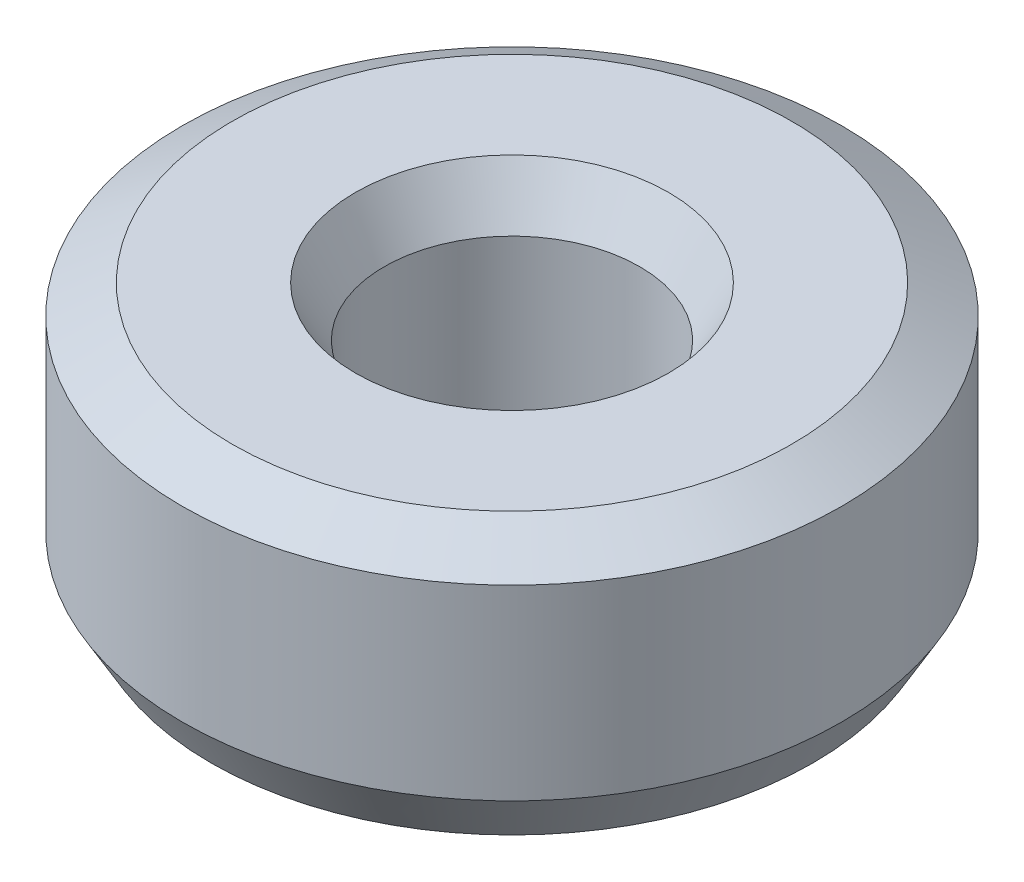
ISO-10303-21;
HEADER;
FILE_DESCRIPTION(('STEP AP214'),'2;1');
FILE_NAME('part.step','',(''),(''),'','','');
FILE_SCHEMA(('AUTOMOTIVE_DESIGN { 1 0 10303 214 1 1 1 1 }'));
ENDSEC;
DATA;
#1=APPLICATION_CONTEXT('core data for automotive mechanical design processes');
#2=APPLICATION_PROTOCOL_DEFINITION('international standard','automotive_design',2000,#1);
#3=PRODUCT_CONTEXT('',#1,'mechanical');
#4=PRODUCT('Part','Part','',(#3));
#5=PRODUCT_RELATED_PRODUCT_CATEGORY('part','',(#4));
#6=PRODUCT_DEFINITION_FORMATION('','',#4);
#7=PRODUCT_DEFINITION_CONTEXT('part definition',#1,'design');
#8=PRODUCT_DEFINITION('design','',#6,#7);
#9=PRODUCT_DEFINITION_SHAPE('','',#8);
#10=(LENGTH_UNIT() NAMED_UNIT(*) SI_UNIT(.MILLI.,.METRE.));
#11=(NAMED_UNIT(*) PLANE_ANGLE_UNIT() SI_UNIT($,.RADIAN.));
#12=(NAMED_UNIT(*) SI_UNIT($,.STERADIAN.) SOLID_ANGLE_UNIT());
#13=UNCERTAINTY_MEASURE_WITH_UNIT(LENGTH_MEASURE(1.E-05),#10,'distance_accuracy_value','');
#14=(GEOMETRIC_REPRESENTATION_CONTEXT(3) GLOBAL_UNCERTAINTY_ASSIGNED_CONTEXT((#13)) GLOBAL_UNIT_ASSIGNED_CONTEXT((#10,
#11,#12)) REPRESENTATION_CONTEXT('',''));
#15=CARTESIAN_POINT('',(0.,0.,0.));
#16=DIRECTION('',(0.,0.,1.));
#17=DIRECTION('',(1.,0.,0.));
#18=AXIS2_PLACEMENT_3D('',#15,#16,#17);
#19=CARTESIAN_POINT('',(0.,10.0671098100684,0.));
#20=DIRECTION('',(0.,-1.,0.));
#21=DIRECTION('',(0.,0.,-1.));
#22=AXIS2_PLACEMENT_3D('',#19,#20,#21);
#23=CYLINDRICAL_SURFACE('',#22,12.5);
#24=CARTESIAN_POINT('',(0.,1.89234666009191,0.));
#25=DIRECTION('',(0.,1.,0.));
#26=DIRECTION('',(0.,0.,1.));
#27=AXIS2_PLACEMENT_3D('',#24,#25,#26);
#28=CIRCLE('',#27,12.5);
#29=CARTESIAN_POINT('',(0.,1.89234666009191,12.5));
#30=VERTEX_POINT('',#29);
#31=EDGE_CURVE('E10',#30,#30,#28,.T.);
#32=ORIENTED_EDGE('',*,*,#31,.T.);
#33=EDGE_LOOP('',(#32));
#34=FACE_BOUND('',#33,.T.);
#35=CARTESIAN_POINT('',(0.,8.97456295646425,0.));
#36=DIRECTION('',(0.,1.,0.));
#37=DIRECTION('',(0.,0.,1.));
#38=AXIS2_PLACEMENT_3D('',#35,#36,#37);
#39=CIRCLE('',#38,12.5);
#40=CARTESIAN_POINT('',(0.,8.97456295646425,12.5));
#41=VERTEX_POINT('',#40);
#42=EDGE_CURVE('E50',#41,#41,#39,.F.);
#43=ORIENTED_EDGE('',*,*,#42,.T.);
#44=EDGE_LOOP('',(#43));
#45=FACE_BOUND('',#44,.T.);
#46=ADVANCED_FACE('F39',(#34,#45),#23,.T.);
#47=CARTESIAN_POINT('',(0.,10.0671098100684,0.));
#48=DIRECTION('',(0.,1.,0.));
#49=DIRECTION('',(0.,0.,1.));
#50=AXIS2_PLACEMENT_3D('',#47,#48,#49);
#51=PLANE('',#50);
#52=CARTESIAN_POINT('',(0.,10.0671098100684,0.));
#53=DIRECTION('',(0.,1.,0.));
#54=DIRECTION('',(0.,0.,1.));
#55=AXIS2_PLACEMENT_3D('',#52,#53,#54);
#56=CIRCLE('',#55,5.93592011887375);
#57=CARTESIAN_POINT('',(0.,10.0671098100684,5.93592011887375));
#58=VERTEX_POINT('',#57);
#59=EDGE_CURVE('E58',#58,#58,#56,.F.);
#60=ORIENTED_EDGE('',*,*,#59,.T.);
#61=EDGE_LOOP('',(#60));
#62=FACE_BOUND('',#61,.T.);
#63=CARTESIAN_POINT('',(0.,10.0671098100684,0.));
#64=DIRECTION('',(0.,1.,0.));
#65=DIRECTION('',(0.,0.,1.));
#66=AXIS2_PLACEMENT_3D('',#63,#64,#65);
#67=CIRCLE('',#66,10.6076533399081);
#68=CARTESIAN_POINT('',(0.,10.0671098100684,10.6076533399081));
#69=VERTEX_POINT('',#68);
#70=EDGE_CURVE('E61',#69,#69,#67,.T.);
#71=ORIENTED_EDGE('',*,*,#70,.T.);
#72=EDGE_LOOP('',(#71));
#73=FACE_BOUND('',#72,.T.);
#74=ADVANCED_FACE('F88',(#62,#73),#51,.T.);
#75=CARTESIAN_POINT('',(0.,0.,0.));
#76=DIRECTION('',(0.,1.,0.));
#77=DIRECTION('',(0.,0.,1.));
#78=AXIS2_PLACEMENT_3D('',#75,#76,#77);
#79=PLANE('',#78);
#80=CARTESIAN_POINT('',(0.,0.,0.));
#81=DIRECTION('',(0.,1.,0.));
#82=DIRECTION('',(0.,0.,1.));
#83=AXIS2_PLACEMENT_3D('',#80,#81,#82);
#84=CIRCLE('',#83,6.73571992536152);
#85=CARTESIAN_POINT('',(0.,0.,6.73571992536152));
#86=VERTEX_POINT('',#85);
#87=EDGE_CURVE('E51',#86,#86,#84,.T.);
#88=ORIENTED_EDGE('',*,*,#87,.T.);
#89=EDGE_LOOP('',(#88));
#90=FACE_BOUND('',#89,.T.);
#91=CARTESIAN_POINT('',(0.,0.,0.));
#92=DIRECTION('',(0.,1.,0.));
#93=DIRECTION('',(0.,0.,1.));
#94=AXIS2_PLACEMENT_3D('',#91,#92,#93);
#95=CIRCLE('',#94,11.4074531463958);
#96=CARTESIAN_POINT('',(0.,0.,11.4074531463958));
#97=VERTEX_POINT('',#96);
#98=EDGE_CURVE('E54',#97,#97,#95,.F.);
#99=ORIENTED_EDGE('',*,*,#98,.T.);
#100=EDGE_LOOP('',(#99));
#101=FACE_BOUND('',#100,.T.);
#102=ADVANCED_FACE('F83',(#90,#101),#79,.F.);
#103=CARTESIAN_POINT('',(0.,10.0671098100684,0.));
#104=DIRECTION('',(0.,-1.,0.));
#105=DIRECTION('',(0.,0.,-1.));
#106=AXIS2_PLACEMENT_3D('',#103,#104,#105);
#107=CYLINDRICAL_SURFACE('',#106,4.84337326526959);
#108=CARTESIAN_POINT('',(0.,8.1747631499765,0.));
#109=DIRECTION('',(0.,1.,0.));
#110=DIRECTION('',(0.,0.,1.));
#111=AXIS2_PLACEMENT_3D('',#108,#109,#110);
#112=CIRCLE('',#111,4.84337326526959);
#113=CARTESIAN_POINT('',(0.,8.1747631499765,4.84337326526959));
#114=VERTEX_POINT('',#113);
#115=EDGE_CURVE('E67',#114,#114,#112,.T.);
#116=ORIENTED_EDGE('',*,*,#115,.T.);
#117=EDGE_LOOP('',(#116));
#118=FACE_BOUND('',#117,.T.);
#119=CARTESIAN_POINT('',(0.,1.09254685360417,0.));
#120=DIRECTION('',(0.,1.,0.));
#121=DIRECTION('',(0.,0.,1.));
#122=AXIS2_PLACEMENT_3D('',#119,#120,#121);
#123=CIRCLE('',#122,4.84337326526959);
#124=CARTESIAN_POINT('',(0.,1.09254685360417,4.84337326526959));
#125=VERTEX_POINT('',#124);
#126=EDGE_CURVE('E69',#125,#125,#123,.F.);
#127=ORIENTED_EDGE('',*,*,#126,.T.);
#128=EDGE_LOOP('',(#127));
#129=FACE_BOUND('',#128,.T.);
#130=ADVANCED_FACE('F71',(#118,#129),#107,.F.);
#131=CARTESIAN_POINT('',(0.,8.1747631499765,0.));
#132=DIRECTION('',(0.,1.,0.));
#133=DIRECTION('',(0.,0.,1.));
#134=AXIS2_PLACEMENT_3D('',#131,#132,#133);
#135=CONICAL_SURFACE('',#134,4.84337326526959,0.523598775598301);
#136=ORIENTED_EDGE('',*,*,#59,.F.);
#137=EDGE_LOOP('',(#136));
#138=FACE_BOUND('',#137,.T.);
#139=ORIENTED_EDGE('',*,*,#115,.F.);
#140=EDGE_LOOP('',(#139));
#141=FACE_BOUND('',#140,.T.);
#142=ADVANCED_FACE('F77',(#138,#141),#135,.F.);
#143=CARTESIAN_POINT('',(0.,0.,0.));
#144=DIRECTION('',(0.,-1.,0.));
#145=DIRECTION('',(0.,0.,-1.));
#146=AXIS2_PLACEMENT_3D('',#143,#144,#145);
#147=CONICAL_SURFACE('',#146,6.73571992536152,1.04719755119659);
#148=ORIENTED_EDGE('',*,*,#126,.F.);
#149=EDGE_LOOP('',(#148));
#150=FACE_BOUND('',#149,.T.);
#151=ORIENTED_EDGE('',*,*,#87,.F.);
#152=EDGE_LOOP('',(#151));
#153=FACE_BOUND('',#152,.T.);
#154=ADVANCED_FACE('F73',(#150,#153),#147,.F.);
#155=CARTESIAN_POINT('',(0.,1.89234666009191,0.));
#156=DIRECTION('',(0.,1.,0.));
#157=DIRECTION('',(0.,0.,1.));
#158=AXIS2_PLACEMENT_3D('',#155,#156,#157);
#159=CONICAL_SURFACE('',#158,12.5,0.523598775598304);
#160=ORIENTED_EDGE('',*,*,#98,.F.);
#161=EDGE_LOOP('',(#160));
#162=FACE_BOUND('',#161,.T.);
#163=ORIENTED_EDGE('',*,*,#31,.F.);
#164=EDGE_LOOP('',(#163));
#165=FACE_BOUND('',#164,.T.);
#166=ADVANCED_FACE('F76',(#162,#165),#159,.T.);
#167=CARTESIAN_POINT('',(0.,10.0671098100684,0.));
#168=DIRECTION('',(0.,-1.,0.));
#169=DIRECTION('',(0.,0.,-1.));
#170=AXIS2_PLACEMENT_3D('',#167,#168,#169);
#171=CONICAL_SURFACE('',#170,10.6076533399081,1.0471975511966);
#172=ORIENTED_EDGE('',*,*,#42,.F.);
#173=EDGE_LOOP('',(#172));
#174=FACE_BOUND('',#173,.T.);
#175=ORIENTED_EDGE('',*,*,#70,.F.);
#176=EDGE_LOOP('',(#175));
#177=FACE_BOUND('',#176,.T.);
#178=ADVANCED_FACE('F45',(#174,#177),#171,.T.);
#179=CLOSED_SHELL('',(#46,#74,#102,#130,#142,#154,#166,#178));
#180=MANIFOLD_SOLID_BREP('B2',#179);
#181=ADVANCED_BREP_SHAPE_REPRESENTATION('',(#18,#180),#14);
#182=SHAPE_DEFINITION_REPRESENTATION(#9,#181);
ENDSEC;
END-ISO-10303-21;
